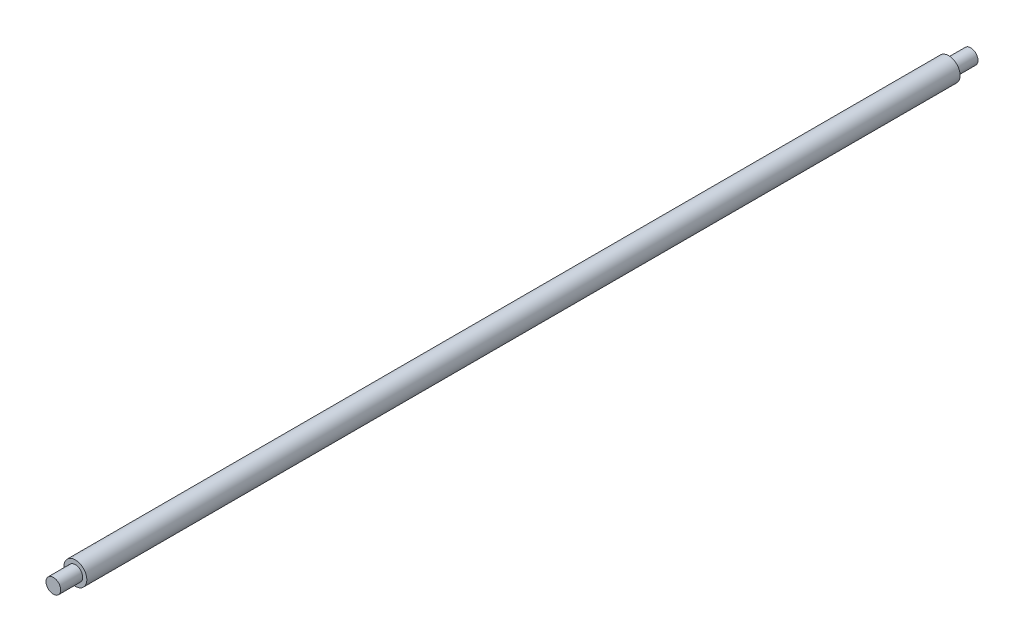
ISO-10303-21;
HEADER;
FILE_DESCRIPTION(('STEP AP214'),'2;1');
FILE_NAME('part.step','',(''),(''),'','','');
FILE_SCHEMA(('AUTOMOTIVE_DESIGN { 1 0 10303 214 1 1 1 1 }'));
ENDSEC;
DATA;
#1=APPLICATION_CONTEXT('core data for automotive mechanical design processes');
#2=APPLICATION_PROTOCOL_DEFINITION('international standard','automotive_design',2000,#1);
#3=PRODUCT_CONTEXT('',#1,'mechanical');
#4=PRODUCT('Part','Part','',(#3));
#5=PRODUCT_RELATED_PRODUCT_CATEGORY('part','',(#4));
#6=PRODUCT_DEFINITION_FORMATION('','',#4);
#7=PRODUCT_DEFINITION_CONTEXT('part definition',#1,'design');
#8=PRODUCT_DEFINITION('design','',#6,#7);
#9=PRODUCT_DEFINITION_SHAPE('','',#8);
#10=(LENGTH_UNIT() NAMED_UNIT(*) SI_UNIT(.MILLI.,.METRE.));
#11=(NAMED_UNIT(*) PLANE_ANGLE_UNIT() SI_UNIT($,.RADIAN.));
#12=(NAMED_UNIT(*) SI_UNIT($,.STERADIAN.) SOLID_ANGLE_UNIT());
#13=UNCERTAINTY_MEASURE_WITH_UNIT(LENGTH_MEASURE(1.E-05),#10,'distance_accuracy_value','');
#14=(GEOMETRIC_REPRESENTATION_CONTEXT(3) GLOBAL_UNCERTAINTY_ASSIGNED_CONTEXT((#13)) GLOBAL_UNIT_ASSIGNED_CONTEXT((#10,
#11,#12)) REPRESENTATION_CONTEXT('',''));
#15=CARTESIAN_POINT('',(0.,0.,0.));
#16=DIRECTION('',(0.,0.,1.));
#17=DIRECTION('',(1.,0.,0.));
#18=AXIS2_PLACEMENT_3D('',#15,#16,#17);
#19=CARTESIAN_POINT('',(0.,0.,-100.));
#20=DIRECTION('',(0.,0.,1.));
#21=DIRECTION('',(1.,0.,0.));
#22=AXIS2_PLACEMENT_3D('',#19,#20,#21);
#23=PLANE('',#22);
#24=CARTESIAN_POINT('',(0.,0.,-100.));
#25=DIRECTION('',(0.,0.,1.));
#26=DIRECTION('',(1.,0.,0.));
#27=AXIS2_PLACEMENT_3D('',#24,#25,#26);
#28=CIRCLE('',#27,0.8);
#29=CARTESIAN_POINT('',(0.8,0.,-100.));
#30=VERTEX_POINT('',#29);
#31=EDGE_CURVE('E17',#30,#30,#28,.T.);
#32=ORIENTED_EDGE('',*,*,#31,.F.);
#33=EDGE_LOOP('',(#32));
#34=FACE_BOUND('',#33,.T.);
#35=ADVANCED_FACE('F14',(#34),#23,.F.);
#36=CARTESIAN_POINT('',(0.,0.8,0.));
#37=DIRECTION('',(0.,0.,-1.));
#38=DIRECTION('',(-1.,0.,0.));
#39=AXIS2_PLACEMENT_3D('',#36,#37,#38);
#40=PLANE('',#39);
#41=CARTESIAN_POINT('',(0.,0.,0.));
#42=DIRECTION('',(0.,0.,1.));
#43=DIRECTION('',(1.,0.,0.));
#44=AXIS2_PLACEMENT_3D('',#41,#42,#43);
#45=CIRCLE('',#44,0.8);
#46=CARTESIAN_POINT('',(0.8,0.,0.));
#47=VERTEX_POINT('',#46);
#48=EDGE_CURVE('E33',#47,#47,#45,.F.);
#49=ORIENTED_EDGE('',*,*,#48,.F.);
#50=EDGE_LOOP('',(#49));
#51=FACE_BOUND('',#50,.T.);
#52=ADVANCED_FACE('F43',(#51),#40,.F.);
#53=CARTESIAN_POINT('',(0.,0.,0.));
#54=DIRECTION('',(0.,0.,1.));
#55=DIRECTION('',(1.,0.,0.));
#56=AXIS2_PLACEMENT_3D('',#53,#54,#55);
#57=CYLINDRICAL_SURFACE('',#56,0.8);
#58=CARTESIAN_POINT('',(0.,0.,-97.6));
#59=DIRECTION('',(0.,0.,1.));
#60=DIRECTION('',(1.,0.,0.));
#61=AXIS2_PLACEMENT_3D('',#58,#59,#60);
#62=CIRCLE('',#61,0.8);
#63=CARTESIAN_POINT('',(0.8,0.,-97.6));
#64=VERTEX_POINT('',#63);
#65=EDGE_CURVE('E31',#64,#64,#62,.F.);
#66=ORIENTED_EDGE('',*,*,#65,.T.);
#67=EDGE_LOOP('',(#66));
#68=FACE_BOUND('',#67,.T.);
#69=ORIENTED_EDGE('',*,*,#31,.T.);
#70=EDGE_LOOP('',(#69));
#71=FACE_BOUND('',#70,.T.);
#72=ADVANCED_FACE('F40',(#68,#71),#57,.T.);
#73=CARTESIAN_POINT('',(0.,0.,0.));
#74=DIRECTION('',(0.,0.,1.));
#75=DIRECTION('',(1.,0.,0.));
#76=AXIS2_PLACEMENT_3D('',#73,#74,#75);
#77=CYLINDRICAL_SURFACE('',#76,0.8);
#78=ORIENTED_EDGE('',*,*,#48,.T.);
#79=EDGE_LOOP('',(#78));
#80=FACE_BOUND('',#79,.T.);
#81=CARTESIAN_POINT('',(0.,0.,-2.4));
#82=DIRECTION('',(0.,0.,1.));
#83=DIRECTION('',(1.,0.,0.));
#84=AXIS2_PLACEMENT_3D('',#81,#82,#83);
#85=CIRCLE('',#84,0.8);
#86=CARTESIAN_POINT('',(0.8,0.,-2.4));
#87=VERTEX_POINT('',#86);
#88=EDGE_CURVE('E26',#87,#87,#85,.T.);
#89=ORIENTED_EDGE('',*,*,#88,.T.);
#90=EDGE_LOOP('',(#89));
#91=FACE_BOUND('',#90,.T.);
#92=ADVANCED_FACE('F64',(#80,#91),#77,.T.);
#93=CARTESIAN_POINT('',(0.,0.8,-97.6));
#94=DIRECTION('',(0.,0.,1.));
#95=DIRECTION('',(1.,0.,0.));
#96=AXIS2_PLACEMENT_3D('',#93,#94,#95);
#97=PLANE('',#96);
#98=ORIENTED_EDGE('',*,*,#65,.F.);
#99=EDGE_LOOP('',(#98));
#100=FACE_BOUND('',#99,.T.);
#101=CARTESIAN_POINT('',(0.,0.,-97.6));
#102=DIRECTION('',(0.,0.,1.));
#103=DIRECTION('',(1.,0.,0.));
#104=AXIS2_PLACEMENT_3D('',#101,#102,#103);
#105=CIRCLE('',#104,1.25);
#106=CARTESIAN_POINT('',(1.25,0.,-97.6));
#107=VERTEX_POINT('',#106);
#108=EDGE_CURVE('E21',#107,#107,#105,.T.);
#109=ORIENTED_EDGE('',*,*,#108,.F.);
#110=EDGE_LOOP('',(#109));
#111=FACE_BOUND('',#110,.T.);
#112=ADVANCED_FACE('F57',(#100,#111),#97,.F.);
#113=CARTESIAN_POINT('',(0.,1.24999999999999,-2.4));
#114=DIRECTION('',(0.,0.,-1.));
#115=DIRECTION('',(-1.,0.,0.));
#116=AXIS2_PLACEMENT_3D('',#113,#114,#115);
#117=PLANE('',#116);
#118=CARTESIAN_POINT('',(0.,0.,-2.4));
#119=DIRECTION('',(0.,0.,1.));
#120=DIRECTION('',(1.,0.,0.));
#121=AXIS2_PLACEMENT_3D('',#118,#119,#120);
#122=CIRCLE('',#121,1.25);
#123=CARTESIAN_POINT('',(1.25,0.,-2.4));
#124=VERTEX_POINT('',#123);
#125=EDGE_CURVE('E10',#124,#124,#122,.F.);
#126=ORIENTED_EDGE('',*,*,#125,.F.);
#127=EDGE_LOOP('',(#126));
#128=FACE_BOUND('',#127,.T.);
#129=ORIENTED_EDGE('',*,*,#88,.F.);
#130=EDGE_LOOP('',(#129));
#131=FACE_BOUND('',#130,.T.);
#132=ADVANCED_FACE('F51',(#128,#131),#117,.F.);
#133=CARTESIAN_POINT('',(0.,0.,0.));
#134=DIRECTION('',(0.,0.,1.));
#135=DIRECTION('',(1.,0.,0.));
#136=AXIS2_PLACEMENT_3D('',#133,#134,#135);
#137=CYLINDRICAL_SURFACE('',#136,1.25);
#138=ORIENTED_EDGE('',*,*,#125,.T.);
#139=EDGE_LOOP('',(#138));
#140=FACE_BOUND('',#139,.T.);
#141=ORIENTED_EDGE('',*,*,#108,.T.);
#142=EDGE_LOOP('',(#141));
#143=FACE_BOUND('',#142,.T.);
#144=ADVANCED_FACE('F49',(#140,#143),#137,.T.);
#145=CLOSED_SHELL('',(#35,#52,#72,#92,#112,#132,#144));
#146=MANIFOLD_SOLID_BREP('B1',#145);
#147=ADVANCED_BREP_SHAPE_REPRESENTATION('',(#18,#146),#14);
#148=SHAPE_DEFINITION_REPRESENTATION(#9,#147);
ENDSEC;
END-ISO-10303-21;
